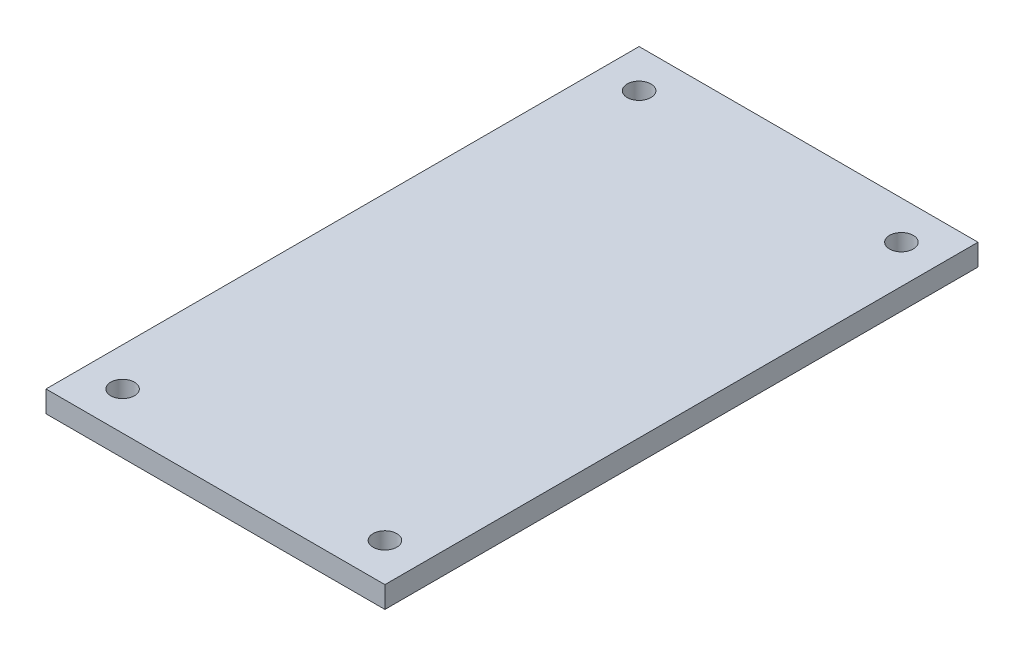
ISO-10303-21;
HEADER;
FILE_DESCRIPTION(('STEP AP214'),'2;1');
FILE_NAME('part.step','',(''),(''),'','','');
FILE_SCHEMA(('AUTOMOTIVE_DESIGN { 1 0 10303 214 1 1 1 1 }'));
ENDSEC;
DATA;
#1=APPLICATION_CONTEXT('core data for automotive mechanical design processes');
#2=APPLICATION_PROTOCOL_DEFINITION('international standard','automotive_design',2000,#1);
#3=PRODUCT_CONTEXT('',#1,'mechanical');
#4=PRODUCT('Part','Part','',(#3));
#5=PRODUCT_RELATED_PRODUCT_CATEGORY('part','',(#4));
#6=PRODUCT_DEFINITION_FORMATION('','',#4);
#7=PRODUCT_DEFINITION_CONTEXT('part definition',#1,'design');
#8=PRODUCT_DEFINITION('design','',#6,#7);
#9=PRODUCT_DEFINITION_SHAPE('','',#8);
#10=(LENGTH_UNIT() NAMED_UNIT(*) SI_UNIT(.MILLI.,.METRE.));
#11=(NAMED_UNIT(*) PLANE_ANGLE_UNIT() SI_UNIT($,.RADIAN.));
#12=(NAMED_UNIT(*) SI_UNIT($,.STERADIAN.) SOLID_ANGLE_UNIT());
#13=UNCERTAINTY_MEASURE_WITH_UNIT(LENGTH_MEASURE(1.E-05),#10,'distance_accuracy_value','');
#14=(GEOMETRIC_REPRESENTATION_CONTEXT(3) GLOBAL_UNCERTAINTY_ASSIGNED_CONTEXT((#13)) GLOBAL_UNIT_ASSIGNED_CONTEXT((#10,
#11,#12)) REPRESENTATION_CONTEXT('',''));
#15=CARTESIAN_POINT('',(0.,0.,0.));
#16=DIRECTION('',(0.,0.,1.));
#17=DIRECTION('',(1.,0.,0.));
#18=AXIS2_PLACEMENT_3D('',#15,#16,#17);
#19=CARTESIAN_POINT('',(0.,6.35,0.));
#20=DIRECTION('',(0.,1.,0.));
#21=DIRECTION('',(0.,0.,1.));
#22=AXIS2_PLACEMENT_3D('',#19,#20,#21);
#23=PLANE('',#22);
#24=CARTESIAN_POINT('',(-11.3,6.35,11.3));
#25=DIRECTION('',(0.,1.,0.));
#26=DIRECTION('',(0.,0.,1.));
#27=AXIS2_PLACEMENT_3D('',#24,#25,#26);
#28=CIRCLE('',#27,3.5);
#29=CARTESIAN_POINT('',(-11.3,6.35,14.8));
#30=VERTEX_POINT('',#29);
#31=EDGE_CURVE('E126',#30,#30,#28,.T.);
#32=ORIENTED_EDGE('',*,*,#31,.F.);
#33=EDGE_LOOP('',(#32));
#34=FACE_BOUND('',#33,.T.);
#35=CARTESIAN_POINT('',(-88.7,6.35,163.7));
#36=DIRECTION('',(0.,1.,0.));
#37=DIRECTION('',(0.,0.,1.));
#38=AXIS2_PLACEMENT_3D('',#35,#36,#37);
#39=CIRCLE('',#38,3.50000000000001);
#40=CARTESIAN_POINT('',(-88.7,6.35,167.2));
#41=VERTEX_POINT('',#40);
#42=EDGE_CURVE('E105',#41,#41,#39,.T.);
#43=ORIENTED_EDGE('',*,*,#42,.F.);
#44=EDGE_LOOP('',(#43));
#45=FACE_BOUND('',#44,.T.);
#46=DIRECTION('',(0.,0.,1.));
#47=VECTOR('',#46,1.);
#48=CARTESIAN_POINT('',(-99.9999999999999,6.35,0.));
#49=LINE('',#48,#47);
#50=CARTESIAN_POINT('',(-99.9999999999999,6.35,0.));
#51=VERTEX_POINT('',#50);
#52=CARTESIAN_POINT('',(-99.9999999999999,6.35,175.));
#53=VERTEX_POINT('',#52);
#54=EDGE_CURVE('E90',#51,#53,#49,.T.);
#55=ORIENTED_EDGE('',*,*,#54,.T.);
#56=DIRECTION('',(1.,0.,0.));
#57=VECTOR('',#56,1.);
#58=CARTESIAN_POINT('',(-99.9999999999999,6.35,175.));
#59=LINE('',#58,#57);
#60=CARTESIAN_POINT('',(0.,6.35,175.));
#61=VERTEX_POINT('',#60);
#62=EDGE_CURVE('E85',#53,#61,#59,.T.);
#63=ORIENTED_EDGE('',*,*,#62,.T.);
#64=DIRECTION('',(0.,0.,-1.));
#65=VECTOR('',#64,1.);
#66=CARTESIAN_POINT('',(0.,6.35,0.));
#67=LINE('',#66,#65);
#68=CARTESIAN_POINT('',(0.,6.35,0.));
#69=VERTEX_POINT('',#68);
#70=EDGE_CURVE('E88',#61,#69,#67,.T.);
#71=ORIENTED_EDGE('',*,*,#70,.T.);
#72=DIRECTION('',(-1.,0.,0.));
#73=VECTOR('',#72,1.);
#74=CARTESIAN_POINT('',(-99.9999999999999,6.35,0.));
#75=LINE('',#74,#73);
#76=EDGE_CURVE('E55',#69,#51,#75,.T.);
#77=ORIENTED_EDGE('',*,*,#76,.T.);
#78=EDGE_LOOP('',(#55,#63,#71,#77));
#79=FACE_BOUND('',#78,.T.);
#80=CARTESIAN_POINT('',(-11.3,6.35,163.7));
#81=DIRECTION('',(0.,1.,0.));
#82=DIRECTION('',(0.,0.,1.));
#83=AXIS2_PLACEMENT_3D('',#80,#81,#82);
#84=CIRCLE('',#83,3.5);
#85=CARTESIAN_POINT('',(-11.3,6.35,167.2));
#86=VERTEX_POINT('',#85);
#87=EDGE_CURVE('E120',#86,#86,#84,.T.);
#88=ORIENTED_EDGE('',*,*,#87,.F.);
#89=EDGE_LOOP('',(#88));
#90=FACE_BOUND('',#89,.T.);
#91=CARTESIAN_POINT('',(-88.7,6.35,11.3));
#92=DIRECTION('',(0.,1.,0.));
#93=DIRECTION('',(0.,0.,1.));
#94=AXIS2_PLACEMENT_3D('',#91,#92,#93);
#95=CIRCLE('',#94,3.50000000000001);
#96=CARTESIAN_POINT('',(-88.7,6.35,14.8));
#97=VERTEX_POINT('',#96);
#98=EDGE_CURVE('E132',#97,#97,#95,.T.);
#99=ORIENTED_EDGE('',*,*,#98,.F.);
#100=EDGE_LOOP('',(#99));
#101=FACE_BOUND('',#100,.T.);
#102=ADVANCED_FACE('F38',(#34,#45,#79,#90,#101),#23,.T.);
#103=CARTESIAN_POINT('',(0.,0.,0.));
#104=DIRECTION('',(0.,1.,0.));
#105=DIRECTION('',(0.,0.,1.));
#106=AXIS2_PLACEMENT_3D('',#103,#104,#105);
#107=PLANE('',#106);
#108=DIRECTION('',(0.,0.,1.));
#109=VECTOR('',#108,1.);
#110=CARTESIAN_POINT('',(-99.9999999999999,0.,0.));
#111=LINE('',#110,#109);
#112=CARTESIAN_POINT('',(-99.9999999999999,0.,0.));
#113=VERTEX_POINT('',#112);
#114=CARTESIAN_POINT('',(-99.9999999999999,0.,175.));
#115=VERTEX_POINT('',#114);
#116=EDGE_CURVE('E102',#113,#115,#111,.T.);
#117=ORIENTED_EDGE('',*,*,#116,.F.);
#118=DIRECTION('',(-1.,0.,0.));
#119=VECTOR('',#118,1.);
#120=CARTESIAN_POINT('',(-99.9999999999999,0.,0.));
#121=LINE('',#120,#119);
#122=CARTESIAN_POINT('',(0.,0.,0.));
#123=VERTEX_POINT('',#122);
#124=EDGE_CURVE('E78',#123,#113,#121,.T.);
#125=ORIENTED_EDGE('',*,*,#124,.F.);
#126=DIRECTION('',(0.,0.,-1.));
#127=VECTOR('',#126,1.);
#128=CARTESIAN_POINT('',(0.,0.,0.));
#129=LINE('',#128,#127);
#130=CARTESIAN_POINT('',(0.,0.,175.));
#131=VERTEX_POINT('',#130);
#132=EDGE_CURVE('E72',#131,#123,#129,.T.);
#133=ORIENTED_EDGE('',*,*,#132,.F.);
#134=DIRECTION('',(1.,0.,0.));
#135=VECTOR('',#134,1.);
#136=CARTESIAN_POINT('',(-99.9999999999999,0.,175.));
#137=LINE('',#136,#135);
#138=EDGE_CURVE('E94',#115,#131,#137,.T.);
#139=ORIENTED_EDGE('',*,*,#138,.F.);
#140=EDGE_LOOP('',(#117,#125,#133,#139));
#141=FACE_BOUND('',#140,.T.);
#142=CARTESIAN_POINT('',(-88.7,0.,163.7));
#143=DIRECTION('',(0.,1.,0.));
#144=DIRECTION('',(0.,0.,1.));
#145=AXIS2_PLACEMENT_3D('',#142,#143,#144);
#146=CIRCLE('',#145,3.50000000000001);
#147=CARTESIAN_POINT('',(-88.7,0.,167.2));
#148=VERTEX_POINT('',#147);
#149=EDGE_CURVE('E117',#148,#148,#146,.T.);
#150=ORIENTED_EDGE('',*,*,#149,.T.);
#151=EDGE_LOOP('',(#150));
#152=FACE_BOUND('',#151,.T.);
#153=CARTESIAN_POINT('',(-11.3,0.,163.7));
#154=DIRECTION('',(0.,1.,0.));
#155=DIRECTION('',(0.,0.,1.));
#156=AXIS2_PLACEMENT_3D('',#153,#154,#155);
#157=CIRCLE('',#156,3.5);
#158=CARTESIAN_POINT('',(-11.3,0.,167.2));
#159=VERTEX_POINT('',#158);
#160=EDGE_CURVE('E123',#159,#159,#157,.T.);
#161=ORIENTED_EDGE('',*,*,#160,.T.);
#162=EDGE_LOOP('',(#161));
#163=FACE_BOUND('',#162,.T.);
#164=CARTESIAN_POINT('',(-11.3,0.,11.3));
#165=DIRECTION('',(0.,1.,0.));
#166=DIRECTION('',(0.,0.,1.));
#167=AXIS2_PLACEMENT_3D('',#164,#165,#166);
#168=CIRCLE('',#167,3.5);
#169=CARTESIAN_POINT('',(-11.3,0.,14.8));
#170=VERTEX_POINT('',#169);
#171=EDGE_CURVE('E129',#170,#170,#168,.T.);
#172=ORIENTED_EDGE('',*,*,#171,.T.);
#173=EDGE_LOOP('',(#172));
#174=FACE_BOUND('',#173,.T.);
#175=CARTESIAN_POINT('',(-88.7,0.,11.3));
#176=DIRECTION('',(0.,1.,0.));
#177=DIRECTION('',(0.,0.,1.));
#178=AXIS2_PLACEMENT_3D('',#175,#176,#177);
#179=CIRCLE('',#178,3.50000000000001);
#180=CARTESIAN_POINT('',(-88.7,0.,14.8));
#181=VERTEX_POINT('',#180);
#182=EDGE_CURVE('E135',#181,#181,#179,.T.);
#183=ORIENTED_EDGE('',*,*,#182,.T.);
#184=EDGE_LOOP('',(#183));
#185=FACE_BOUND('',#184,.T.);
#186=ADVANCED_FACE('F113',(#141,#152,#163,#174,#185),#107,.F.);
#187=CARTESIAN_POINT('',(-99.9999999999999,6.35,0.));
#188=DIRECTION('',(1.,0.,0.));
#189=DIRECTION('',(0.,0.,-1.));
#190=AXIS2_PLACEMENT_3D('',#187,#188,#189);
#191=PLANE('',#190);
#192=ORIENTED_EDGE('',*,*,#116,.T.);
#193=DIRECTION('',(0.,-1.,0.));
#194=VECTOR('',#193,1.);
#195=CARTESIAN_POINT('',(-99.9999999999999,6.35,175.));
#196=LINE('',#195,#194);
#197=EDGE_CURVE('E11',#53,#115,#196,.T.);
#198=ORIENTED_EDGE('',*,*,#197,.F.);
#199=ORIENTED_EDGE('',*,*,#54,.F.);
#200=DIRECTION('',(0.,-1.,0.));
#201=VECTOR('',#200,1.);
#202=CARTESIAN_POINT('',(-99.9999999999999,6.35,0.));
#203=LINE('',#202,#201);
#204=EDGE_CURVE('E98',#51,#113,#203,.T.);
#205=ORIENTED_EDGE('',*,*,#204,.T.);
#206=EDGE_LOOP('',(#192,#198,#199,#205));
#207=FACE_BOUND('',#206,.T.);
#208=ADVANCED_FACE('F40',(#207),#191,.F.);
#209=CARTESIAN_POINT('',(-99.9999999999999,6.35,175.));
#210=DIRECTION('',(0.,0.,-1.));
#211=DIRECTION('',(-1.,0.,0.));
#212=AXIS2_PLACEMENT_3D('',#209,#210,#211);
#213=PLANE('',#212);
#214=ORIENTED_EDGE('',*,*,#138,.T.);
#215=DIRECTION('',(0.,-1.,0.));
#216=VECTOR('',#215,1.);
#217=CARTESIAN_POINT('',(0.,6.35,175.));
#218=LINE('',#217,#216);
#219=EDGE_CURVE('E47',#61,#131,#218,.T.);
#220=ORIENTED_EDGE('',*,*,#219,.F.);
#221=ORIENTED_EDGE('',*,*,#62,.F.);
#222=ORIENTED_EDGE('',*,*,#197,.T.);
#223=EDGE_LOOP('',(#214,#220,#221,#222));
#224=FACE_BOUND('',#223,.T.);
#225=ADVANCED_FACE('F93',(#224),#213,.F.);
#226=CARTESIAN_POINT('',(0.,6.35,0.));
#227=DIRECTION('',(-1.,0.,0.));
#228=DIRECTION('',(0.,0.,1.));
#229=AXIS2_PLACEMENT_3D('',#226,#227,#228);
#230=PLANE('',#229);
#231=ORIENTED_EDGE('',*,*,#132,.T.);
#232=DIRECTION('',(0.,-1.,0.));
#233=VECTOR('',#232,1.);
#234=CARTESIAN_POINT('',(0.,6.35,0.));
#235=LINE('',#234,#233);
#236=EDGE_CURVE('E95',#69,#123,#235,.T.);
#237=ORIENTED_EDGE('',*,*,#236,.F.);
#238=ORIENTED_EDGE('',*,*,#70,.F.);
#239=ORIENTED_EDGE('',*,*,#219,.T.);
#240=EDGE_LOOP('',(#231,#237,#238,#239));
#241=FACE_BOUND('',#240,.T.);
#242=ADVANCED_FACE('F96',(#241),#230,.F.);
#243=CARTESIAN_POINT('',(-99.9999999999999,6.35,0.));
#244=DIRECTION('',(0.,0.,1.));
#245=DIRECTION('',(1.,0.,0.));
#246=AXIS2_PLACEMENT_3D('',#243,#244,#245);
#247=PLANE('',#246);
#248=ORIENTED_EDGE('',*,*,#124,.T.);
#249=ORIENTED_EDGE('',*,*,#204,.F.);
#250=ORIENTED_EDGE('',*,*,#76,.F.);
#251=ORIENTED_EDGE('',*,*,#236,.T.);
#252=EDGE_LOOP('',(#248,#249,#250,#251));
#253=FACE_BOUND('',#252,.T.);
#254=ADVANCED_FACE('F110',(#253),#247,.F.);
#255=CARTESIAN_POINT('',(-88.7,6.35,163.7));
#256=DIRECTION('',(0.,-1.,0.));
#257=DIRECTION('',(0.,0.,-1.));
#258=AXIS2_PLACEMENT_3D('',#255,#256,#257);
#259=CYLINDRICAL_SURFACE('',#258,3.50000000000001);
#260=ORIENTED_EDGE('',*,*,#42,.T.);
#261=EDGE_LOOP('',(#260));
#262=FACE_BOUND('',#261,.T.);
#263=ORIENTED_EDGE('',*,*,#149,.F.);
#264=EDGE_LOOP('',(#263));
#265=FACE_BOUND('',#264,.T.);
#266=ADVANCED_FACE('F154',(#262,#265),#259,.F.);
#267=CARTESIAN_POINT('',(-11.3,6.35,163.7));
#268=DIRECTION('',(0.,-1.,0.));
#269=DIRECTION('',(0.,0.,-1.));
#270=AXIS2_PLACEMENT_3D('',#267,#268,#269);
#271=CYLINDRICAL_SURFACE('',#270,3.5);
#272=ORIENTED_EDGE('',*,*,#87,.T.);
#273=EDGE_LOOP('',(#272));
#274=FACE_BOUND('',#273,.T.);
#275=ORIENTED_EDGE('',*,*,#160,.F.);
#276=EDGE_LOOP('',(#275));
#277=FACE_BOUND('',#276,.T.);
#278=ADVANCED_FACE('F208',(#274,#277),#271,.F.);
#279=CARTESIAN_POINT('',(-11.3,6.35,11.3));
#280=DIRECTION('',(0.,-1.,0.));
#281=DIRECTION('',(0.,0.,-1.));
#282=AXIS2_PLACEMENT_3D('',#279,#280,#281);
#283=CYLINDRICAL_SURFACE('',#282,3.5);
#284=ORIENTED_EDGE('',*,*,#31,.T.);
#285=EDGE_LOOP('',(#284));
#286=FACE_BOUND('',#285,.T.);
#287=ORIENTED_EDGE('',*,*,#171,.F.);
#288=EDGE_LOOP('',(#287));
#289=FACE_BOUND('',#288,.T.);
#290=ADVANCED_FACE('F217',(#286,#289),#283,.F.);
#291=CARTESIAN_POINT('',(-88.7,6.35,11.3));
#292=DIRECTION('',(0.,-1.,0.));
#293=DIRECTION('',(0.,0.,-1.));
#294=AXIS2_PLACEMENT_3D('',#291,#292,#293);
#295=CYLINDRICAL_SURFACE('',#294,3.50000000000001);
#296=ORIENTED_EDGE('',*,*,#98,.T.);
#297=EDGE_LOOP('',(#296));
#298=FACE_BOUND('',#297,.T.);
#299=ORIENTED_EDGE('',*,*,#182,.F.);
#300=EDGE_LOOP('',(#299));
#301=FACE_BOUND('',#300,.T.);
#302=ADVANCED_FACE('F141',(#298,#301),#295,.F.);
#303=CLOSED_SHELL('',(#102,#186,#208,#225,#242,#254,#266,#278,#290,#302));
#304=MANIFOLD_SOLID_BREP('B2',#303);
#305=ADVANCED_BREP_SHAPE_REPRESENTATION('',(#18,#304),#14);
#306=SHAPE_DEFINITION_REPRESENTATION(#9,#305);
ENDSEC;
END-ISO-10303-21;
